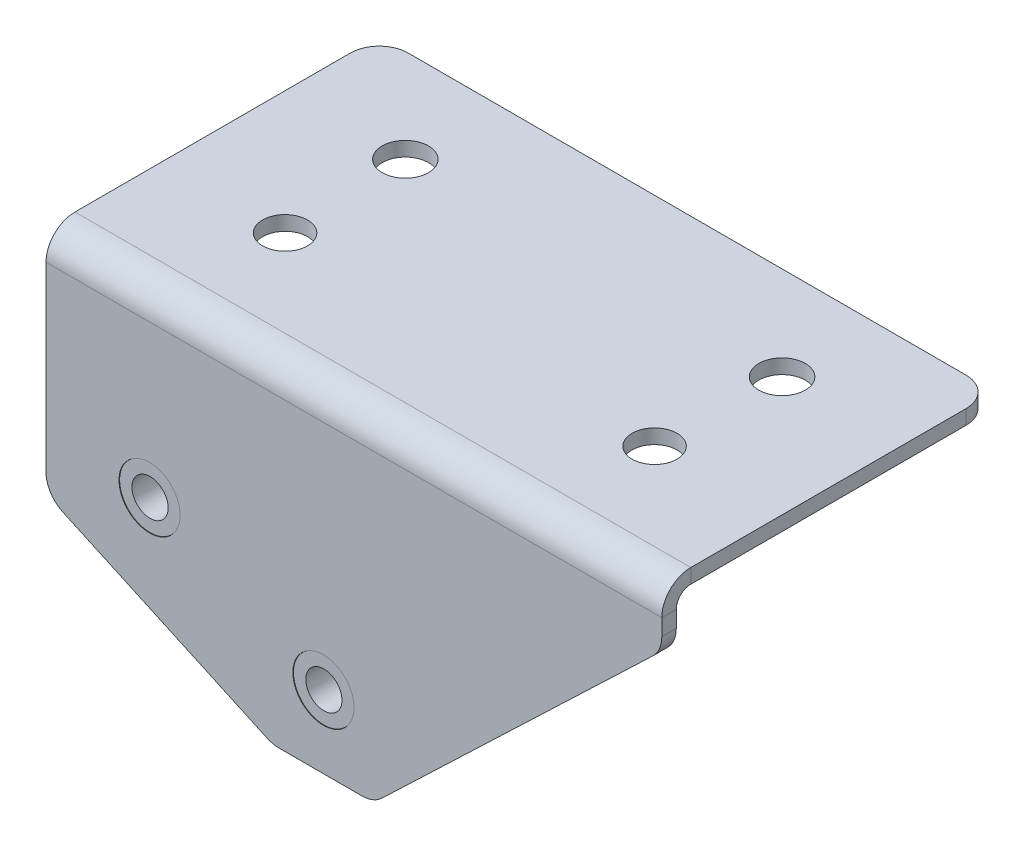
ISO-10303-21;
HEADER;
FILE_DESCRIPTION(('STEP AP214'),'2;1');
FILE_NAME('part.step','',(''),(''),'','','');
FILE_SCHEMA(('AUTOMOTIVE_DESIGN { 1 0 10303 214 1 1 1 1 }'));
ENDSEC;
DATA;
#1=APPLICATION_CONTEXT('core data for automotive mechanical design processes');
#2=APPLICATION_PROTOCOL_DEFINITION('international standard','automotive_design',2000,#1);
#3=PRODUCT_CONTEXT('',#1,'mechanical');
#4=PRODUCT('Part','Part','',(#3));
#5=PRODUCT_RELATED_PRODUCT_CATEGORY('part','',(#4));
#6=PRODUCT_DEFINITION_FORMATION('','',#4);
#7=PRODUCT_DEFINITION_CONTEXT('part definition',#1,'design');
#8=PRODUCT_DEFINITION('design','',#6,#7);
#9=PRODUCT_DEFINITION_SHAPE('','',#8);
#10=(LENGTH_UNIT() NAMED_UNIT(*) SI_UNIT(.MILLI.,.METRE.));
#11=(NAMED_UNIT(*) PLANE_ANGLE_UNIT() SI_UNIT($,.RADIAN.));
#12=(NAMED_UNIT(*) SI_UNIT($,.STERADIAN.) SOLID_ANGLE_UNIT());
#13=UNCERTAINTY_MEASURE_WITH_UNIT(LENGTH_MEASURE(1.E-05),#10,'distance_accuracy_value','');
#14=(GEOMETRIC_REPRESENTATION_CONTEXT(3) GLOBAL_UNCERTAINTY_ASSIGNED_CONTEXT((#13)) GLOBAL_UNIT_ASSIGNED_CONTEXT((#10,
#11,#12)) REPRESENTATION_CONTEXT('',''));
#15=CARTESIAN_POINT('',(0.,0.,0.));
#16=DIRECTION('',(0.,0.,1.));
#17=DIRECTION('',(1.,0.,0.));
#18=AXIS2_PLACEMENT_3D('',#15,#16,#17);
#19=CARTESIAN_POINT('',(7.14999999999999,10.5,-2.5));
#20=DIRECTION('',(0.,0.,1.));
#21=DIRECTION('',(1.,0.,0.));
#22=AXIS2_PLACEMENT_3D('',#19,#20,#21);
#23=PLANE('',#22);
#24=CARTESIAN_POINT('',(7.14999999999999,10.5,-2.5));
#25=DIRECTION('',(0.,0.,-1.));
#26=DIRECTION('',(0.,1.,0.));
#27=AXIS2_PLACEMENT_3D('',#24,#25,#26);
#28=CIRCLE('',#27,1.24999999999999);
#29=CARTESIAN_POINT('',(7.14999999999999,11.75,-2.5));
#30=VERTEX_POINT('',#29);
#31=EDGE_CURVE('E69',#30,#30,#28,.T.);
#32=ORIENTED_EDGE('',*,*,#31,.F.);
#33=EDGE_LOOP('',(#32));
#34=FACE_BOUND('',#33,.T.);
#35=CARTESIAN_POINT('',(7.14999999999999,10.5,-2.5));
#36=DIRECTION('',(0.,0.,-1.));
#37=DIRECTION('',(-1.,0.,0.));
#38=AXIS2_PLACEMENT_3D('',#35,#36,#37);
#39=CIRCLE('',#38,3.15);
#40=CARTESIAN_POINT('',(3.99999999999999,10.5,-2.5));
#41=VERTEX_POINT('',#40);
#42=EDGE_CURVE('E11',#41,#41,#39,.T.);
#43=ORIENTED_EDGE('',*,*,#42,.T.);
#44=EDGE_LOOP('',(#43));
#45=FACE_BOUND('',#44,.T.);
#46=ADVANCED_FACE('F47',(#34,#45),#23,.F.);
#47=CARTESIAN_POINT('',(7.14999999999999,10.5,-2.5));
#48=DIRECTION('',(0.,0.,-1.));
#49=DIRECTION('',(-1.,0.,0.));
#50=AXIS2_PLACEMENT_3D('',#47,#48,#49);
#51=CYLINDRICAL_SURFACE('',#50,3.15);
#52=ORIENTED_EDGE('',*,*,#42,.F.);
#53=EDGE_LOOP('',(#52));
#54=FACE_BOUND('',#53,.T.);
#55=CARTESIAN_POINT('',(7.14999999999999,10.5,-1.));
#56=DIRECTION('',(0.,0.,-1.));
#57=DIRECTION('',(-1.,0.,0.));
#58=AXIS2_PLACEMENT_3D('',#55,#56,#57);
#59=CIRCLE('',#58,3.15);
#60=CARTESIAN_POINT('',(3.99999999999999,10.5,-1.));
#61=VERTEX_POINT('',#60);
#62=EDGE_CURVE('E53',#61,#61,#59,.T.);
#63=ORIENTED_EDGE('',*,*,#62,.T.);
#64=EDGE_LOOP('',(#63));
#65=FACE_BOUND('',#64,.T.);
#66=ADVANCED_FACE('F77',(#54,#65),#51,.T.);
#67=CARTESIAN_POINT('',(10.3,10.5,-1.));
#68=DIRECTION('',(0.,0.,-1.));
#69=DIRECTION('',(-1.,0.,0.));
#70=AXIS2_PLACEMENT_3D('',#67,#68,#69);
#71=PLANE('',#70);
#72=ORIENTED_EDGE('',*,*,#62,.F.);
#73=EDGE_LOOP('',(#72));
#74=FACE_BOUND('',#73,.T.);
#75=CARTESIAN_POINT('',(7.14999999999999,10.5,-1.));
#76=DIRECTION('',(0.,0.,-1.));
#77=DIRECTION('',(-1.,0.,0.));
#78=AXIS2_PLACEMENT_3D('',#75,#76,#77);
#79=CIRCLE('',#78,2.1);
#80=CARTESIAN_POINT('',(5.04999999999998,10.5,-1.));
#81=VERTEX_POINT('',#80);
#82=EDGE_CURVE('E57',#81,#81,#79,.T.);
#83=ORIENTED_EDGE('',*,*,#82,.T.);
#84=EDGE_LOOP('',(#83));
#85=FACE_BOUND('',#84,.T.);
#86=ADVANCED_FACE('F81',(#74,#85),#71,.F.);
#87=CARTESIAN_POINT('',(7.14999999999999,10.5,-2.5));
#88=DIRECTION('',(0.,0.,-1.));
#89=DIRECTION('',(-1.,0.,0.));
#90=AXIS2_PLACEMENT_3D('',#87,#88,#89);
#91=CYLINDRICAL_SURFACE('',#90,2.1);
#92=ORIENTED_EDGE('',*,*,#82,.F.);
#93=EDGE_LOOP('',(#92));
#94=FACE_BOUND('',#93,.T.);
#95=CARTESIAN_POINT('',(7.14999999999999,10.5,-0.0300000000000014));
#96=DIRECTION('',(0.,0.,-1.));
#97=DIRECTION('',(-1.,0.,0.));
#98=AXIS2_PLACEMENT_3D('',#95,#96,#97);
#99=CIRCLE('',#98,2.1);
#100=CARTESIAN_POINT('',(5.04999999999998,10.5,-0.0300000000000014));
#101=VERTEX_POINT('',#100);
#102=EDGE_CURVE('E61',#101,#101,#99,.T.);
#103=ORIENTED_EDGE('',*,*,#102,.T.);
#104=EDGE_LOOP('',(#103));
#105=FACE_BOUND('',#104,.T.);
#106=ADVANCED_FACE('F86',(#94,#105),#91,.T.);
#107=CARTESIAN_POINT('',(9.24999999999999,10.5,-0.0300000000000014));
#108=DIRECTION('',(0.,0.,-1.));
#109=DIRECTION('',(-1.,0.,0.));
#110=AXIS2_PLACEMENT_3D('',#107,#108,#109);
#111=PLANE('',#110);
#112=CARTESIAN_POINT('',(7.14999999999999,10.5,-0.0300000000000014));
#113=DIRECTION('',(0.,0.,-1.));
#114=DIRECTION('',(-1.,0.,0.));
#115=AXIS2_PLACEMENT_3D('',#112,#113,#114);
#116=CIRCLE('',#115,1.24999999999999);
#117=CARTESIAN_POINT('',(5.9,10.5,-0.0300000000000014));
#118=VERTEX_POINT('',#117);
#119=EDGE_CURVE('E66',#118,#118,#116,.T.);
#120=ORIENTED_EDGE('',*,*,#119,.T.);
#121=EDGE_LOOP('',(#120));
#122=FACE_BOUND('',#121,.T.);
#123=ORIENTED_EDGE('',*,*,#102,.F.);
#124=EDGE_LOOP('',(#123));
#125=FACE_BOUND('',#124,.T.);
#126=ADVANCED_FACE('F92',(#122,#125),#111,.F.);
#127=CARTESIAN_POINT('',(7.14999999999999,10.5,-2.5));
#128=DIRECTION('',(0.,0.,-1.));
#129=DIRECTION('',(0.,1.,0.));
#130=AXIS2_PLACEMENT_3D('',#127,#128,#129);
#131=CYLINDRICAL_SURFACE('',#130,1.24999999999999);
#132=ORIENTED_EDGE('',*,*,#31,.T.);
#133=EDGE_LOOP('',(#132));
#134=FACE_BOUND('',#133,.T.);
#135=ORIENTED_EDGE('',*,*,#119,.F.);
#136=EDGE_LOOP('',(#135));
#137=FACE_BOUND('',#136,.T.);
#138=ADVANCED_FACE('F73',(#134,#137),#131,.F.);
#139=CLOSED_SHELL('',(#46,#66,#86,#106,#126,#138));
#140=MANIFOLD_SOLID_BREP('B2',#139);
#141=CARTESIAN_POINT('',(19.15,5.,-2.5));
#142=DIRECTION('',(0.,0.,1.));
#143=DIRECTION('',(1.,0.,0.));
#144=AXIS2_PLACEMENT_3D('',#141,#142,#143);
#145=PLANE('',#144);
#146=CARTESIAN_POINT('',(19.15,5.,-2.5));
#147=DIRECTION('',(0.,0.,-1.));
#148=DIRECTION('',(0.,1.,0.));
#149=AXIS2_PLACEMENT_3D('',#146,#147,#148);
#150=CIRCLE('',#149,1.24999999999999);
#151=CARTESIAN_POINT('',(19.15,6.24999999999999,-2.5));
#152=VERTEX_POINT('',#151);
#153=EDGE_CURVE('E184',#152,#152,#150,.T.);
#154=ORIENTED_EDGE('',*,*,#153,.F.);
#155=EDGE_LOOP('',(#154));
#156=FACE_BOUND('',#155,.T.);
#157=CARTESIAN_POINT('',(19.15,5.,-2.5));
#158=DIRECTION('',(0.,0.,-1.));
#159=DIRECTION('',(-1.,0.,0.));
#160=AXIS2_PLACEMENT_3D('',#157,#158,#159);
#161=CIRCLE('',#160,3.15);
#162=CARTESIAN_POINT('',(16.,5.,-2.5));
#163=VERTEX_POINT('',#162);
#164=EDGE_CURVE('E46',#163,#163,#161,.T.);
#165=ORIENTED_EDGE('',*,*,#164,.T.);
#166=EDGE_LOOP('',(#165));
#167=FACE_BOUND('',#166,.T.);
#168=ADVANCED_FACE('F162',(#156,#167),#145,.F.);
#169=CARTESIAN_POINT('',(19.15,5.,-2.5));
#170=DIRECTION('',(0.,0.,-1.));
#171=DIRECTION('',(-1.,0.,0.));
#172=AXIS2_PLACEMENT_3D('',#169,#170,#171);
#173=CYLINDRICAL_SURFACE('',#172,3.15);
#174=ORIENTED_EDGE('',*,*,#164,.F.);
#175=EDGE_LOOP('',(#174));
#176=FACE_BOUND('',#175,.T.);
#177=CARTESIAN_POINT('',(19.15,5.,-1.));
#178=DIRECTION('',(0.,0.,-1.));
#179=DIRECTION('',(-1.,0.,0.));
#180=AXIS2_PLACEMENT_3D('',#177,#178,#179);
#181=CIRCLE('',#180,3.15);
#182=CARTESIAN_POINT('',(16.,5.,-1.));
#183=VERTEX_POINT('',#182);
#184=EDGE_CURVE('E168',#183,#183,#181,.T.);
#185=ORIENTED_EDGE('',*,*,#184,.T.);
#186=EDGE_LOOP('',(#185));
#187=FACE_BOUND('',#186,.T.);
#188=ADVANCED_FACE('F192',(#176,#187),#173,.T.);
#189=CARTESIAN_POINT('',(22.3,5.,-1.));
#190=DIRECTION('',(0.,0.,-1.));
#191=DIRECTION('',(-1.,0.,0.));
#192=AXIS2_PLACEMENT_3D('',#189,#190,#191);
#193=PLANE('',#192);
#194=ORIENTED_EDGE('',*,*,#184,.F.);
#195=EDGE_LOOP('',(#194));
#196=FACE_BOUND('',#195,.T.);
#197=CARTESIAN_POINT('',(19.15,5.,-1.));
#198=DIRECTION('',(0.,0.,-1.));
#199=DIRECTION('',(-1.,0.,0.));
#200=AXIS2_PLACEMENT_3D('',#197,#198,#199);
#201=CIRCLE('',#200,2.1);
#202=CARTESIAN_POINT('',(17.05,5.,-1.));
#203=VERTEX_POINT('',#202);
#204=EDGE_CURVE('E172',#203,#203,#201,.T.);
#205=ORIENTED_EDGE('',*,*,#204,.T.);
#206=EDGE_LOOP('',(#205));
#207=FACE_BOUND('',#206,.T.);
#208=ADVANCED_FACE('F196',(#196,#207),#193,.F.);
#209=CARTESIAN_POINT('',(19.15,5.,-2.5));
#210=DIRECTION('',(0.,0.,-1.));
#211=DIRECTION('',(-1.,0.,0.));
#212=AXIS2_PLACEMENT_3D('',#209,#210,#211);
#213=CYLINDRICAL_SURFACE('',#212,2.1);
#214=ORIENTED_EDGE('',*,*,#204,.F.);
#215=EDGE_LOOP('',(#214));
#216=FACE_BOUND('',#215,.T.);
#217=CARTESIAN_POINT('',(19.15,5.,-0.0300000000000018));
#218=DIRECTION('',(0.,0.,-1.));
#219=DIRECTION('',(-1.,0.,0.));
#220=AXIS2_PLACEMENT_3D('',#217,#218,#219);
#221=CIRCLE('',#220,2.1);
#222=CARTESIAN_POINT('',(17.05,5.,-0.0300000000000018));
#223=VERTEX_POINT('',#222);
#224=EDGE_CURVE('E176',#223,#223,#221,.T.);
#225=ORIENTED_EDGE('',*,*,#224,.T.);
#226=EDGE_LOOP('',(#225));
#227=FACE_BOUND('',#226,.T.);
#228=ADVANCED_FACE('F201',(#216,#227),#213,.T.);
#229=CARTESIAN_POINT('',(21.25,5.,-0.0300000000000016));
#230=DIRECTION('',(0.,0.,-1.));
#231=DIRECTION('',(-1.,0.,0.));
#232=AXIS2_PLACEMENT_3D('',#229,#230,#231);
#233=PLANE('',#232);
#234=CARTESIAN_POINT('',(19.15,5.,-0.0300000000000018));
#235=DIRECTION('',(0.,0.,-1.));
#236=DIRECTION('',(-1.,0.,0.));
#237=AXIS2_PLACEMENT_3D('',#234,#235,#236);
#238=CIRCLE('',#237,1.24999999999999);
#239=CARTESIAN_POINT('',(17.9,5.,-0.0300000000000018));
#240=VERTEX_POINT('',#239);
#241=EDGE_CURVE('E181',#240,#240,#238,.T.);
#242=ORIENTED_EDGE('',*,*,#241,.T.);
#243=EDGE_LOOP('',(#242));
#244=FACE_BOUND('',#243,.T.);
#245=ORIENTED_EDGE('',*,*,#224,.F.);
#246=EDGE_LOOP('',(#245));
#247=FACE_BOUND('',#246,.T.);
#248=ADVANCED_FACE('F207',(#244,#247),#233,.F.);
#249=CARTESIAN_POINT('',(19.15,5.,-2.5));
#250=DIRECTION('',(0.,0.,-1.));
#251=DIRECTION('',(0.,1.,0.));
#252=AXIS2_PLACEMENT_3D('',#249,#250,#251);
#253=CYLINDRICAL_SURFACE('',#252,1.24999999999999);
#254=ORIENTED_EDGE('',*,*,#153,.T.);
#255=EDGE_LOOP('',(#254));
#256=FACE_BOUND('',#255,.T.);
#257=ORIENTED_EDGE('',*,*,#241,.F.);
#258=EDGE_LOOP('',(#257));
#259=FACE_BOUND('',#258,.T.);
#260=ADVANCED_FACE('F188',(#256,#259),#253,.F.);
#261=CLOSED_SHELL('',(#168,#188,#208,#228,#248,#260));
#262=MANIFOLD_SOLID_BREP('B6',#261);
#263=CARTESIAN_POINT('',(0.,0.,-1.));
#264=DIRECTION('',(0.,0.,-1.));
#265=DIRECTION('',(-1.,0.,0.));
#266=AXIS2_PLACEMENT_3D('',#263,#264,#265);
#267=PLANE('',#266);
#268=CARTESIAN_POINT('',(19.15,5.,-1.));
#269=DIRECTION('',(0.,0.,1.));
#270=DIRECTION('',(1.,0.,0.));
#271=AXIS2_PLACEMENT_3D('',#268,#269,#270);
#272=CIRCLE('',#271,2.11);
#273=CARTESIAN_POINT('',(21.26,5.,-1.));
#274=VERTEX_POINT('',#273);
#275=EDGE_CURVE('E528',#274,#274,#272,.T.);
#276=ORIENTED_EDGE('',*,*,#275,.T.);
#277=EDGE_LOOP('',(#276));
#278=FACE_BOUND('',#277,.T.);
#279=CARTESIAN_POINT('',(7.14999999999999,10.5,-1.));
#280=DIRECTION('',(0.,0.,1.));
#281=DIRECTION('',(1.,0.,0.));
#282=AXIS2_PLACEMENT_3D('',#279,#280,#281);
#283=CIRCLE('',#282,2.11);
#284=CARTESIAN_POINT('',(9.25999999999999,10.5,-1.));
#285=VERTEX_POINT('',#284);
#286=EDGE_CURVE('E523',#285,#285,#283,.T.);
#287=ORIENTED_EDGE('',*,*,#286,.T.);
#288=EDGE_LOOP('',(#287));
#289=FACE_BOUND('',#288,.T.);
#290=DIRECTION('',(0.,1.,0.));
#291=VECTOR('',#290,1.);
#292=CARTESIAN_POINT('',(42.5,0.,-1.));
#293=LINE('',#292,#291);
#294=CARTESIAN_POINT('',(42.5,19.8556065200386,-1.));
#295=VERTEX_POINT('',#294);
#296=CARTESIAN_POINT('',(42.5,21.,-1.));
#297=VERTEX_POINT('',#296);
#298=EDGE_CURVE('E448',#295,#297,#293,.T.);
#299=ORIENTED_EDGE('',*,*,#298,.F.);
#300=CARTESIAN_POINT('',(40.5,19.8556065200386,-1.));
#301=DIRECTION('',(0.,0.,-1.));
#302=DIRECTION('',(-1.,0.,0.));
#303=AXIS2_PLACEMENT_3D('',#300,#301,#302);
#304=CIRCLE('',#303,2.);
#305=CARTESIAN_POINT('',(41.8811894796554,18.4091226378991,-1.));
#306=VERTEX_POINT('',#305);
#307=EDGE_CURVE('E477',#295,#306,#304,.T.);
#308=ORIENTED_EDGE('',*,*,#307,.T.);
#309=DIRECTION('',(0.723241941069744,0.690594739827686,0.));
#310=VECTOR('',#309,1.);
#311=CARTESIAN_POINT('',(10.7792720014158,-11.2888517042107,-1.));
#312=LINE('',#311,#310);
#313=CARTESIAN_POINT('',(23.1814763573797,0.553516117860515,-1.));
#314=VERTEX_POINT('',#313);
#315=EDGE_CURVE('E537',#314,#306,#312,.T.);
#316=ORIENTED_EDGE('',*,*,#315,.F.);
#317=CARTESIAN_POINT('',(21.8002868777243,2.,-1.));
#318=DIRECTION('',(0.,0.,-1.));
#319=DIRECTION('',(-1.,0.,0.));
#320=AXIS2_PLACEMENT_3D('',#317,#318,#319);
#321=CIRCLE('',#320,2.);
#322=CARTESIAN_POINT('',(21.8002868777243,0.,-1.));
#323=VERTEX_POINT('',#322);
#324=EDGE_CURVE('E475',#314,#323,#321,.T.);
#325=ORIENTED_EDGE('',*,*,#324,.T.);
#326=DIRECTION('',(1.,0.,0.));
#327=VECTOR('',#326,1.);
#328=CARTESIAN_POINT('',(0.,0.,-1.));
#329=LINE('',#328,#327);
#330=CARTESIAN_POINT('',(16.0951790673134,0.,-1.));
#331=VERTEX_POINT('',#330);
#332=EDGE_CURVE('E444',#331,#323,#329,.T.);
#333=ORIENTED_EDGE('',*,*,#332,.F.);
#334=CARTESIAN_POINT('',(16.0951790673134,2.,-1.));
#335=DIRECTION('',(0.,0.,-1.));
#336=DIRECTION('',(-1.,0.,0.));
#337=AXIS2_PLACEMENT_3D('',#334,#335,#336);
#338=CIRCLE('',#337,2.);
#339=CARTESIAN_POINT('',(15.261869646327,0.18187035421143,-1.));
#340=VERTEX_POINT('',#339);
#341=EDGE_CURVE('E473',#331,#340,#338,.T.);
#342=ORIENTED_EDGE('',*,*,#341,.T.);
#343=DIRECTION('',(0.909064822894284,-0.416654710493214,0.));
#344=VECTOR('',#343,1.);
#345=CARTESIAN_POINT('',(2.71836441996754,5.93097691629283,-1.));
#346=LINE('',#345,#344);
#347=CARTESIAN_POINT('',(1.16669057901357,6.6421607600634,-1.));
#348=VERTEX_POINT('',#347);
#349=EDGE_CURVE('E543',#348,#340,#346,.T.);
#350=ORIENTED_EDGE('',*,*,#349,.F.);
#351=CARTESIAN_POINT('',(1.99999999999999,8.46029040585197,-1.));
#352=DIRECTION('',(0.,0.,-1.));
#353=DIRECTION('',(-1.,0.,0.));
#354=AXIS2_PLACEMENT_3D('',#351,#352,#353);
#355=CIRCLE('',#354,2.);
#356=CARTESIAN_POINT('',(0.,8.46029040585197,-1.));
#357=VERTEX_POINT('',#356);
#358=EDGE_CURVE('E471',#348,#357,#355,.T.);
#359=ORIENTED_EDGE('',*,*,#358,.T.);
#360=DIRECTION('',(0.,-1.,0.));
#361=VECTOR('',#360,1.);
#362=CARTESIAN_POINT('',(0.,0.,-1.));
#363=LINE('',#362,#361);
#364=CARTESIAN_POINT('',(0.,21.,-1.));
#365=VERTEX_POINT('',#364);
#366=EDGE_CURVE('E441',#365,#357,#363,.T.);
#367=ORIENTED_EDGE('',*,*,#366,.F.);
#368=DIRECTION('',(1.,0.,0.));
#369=VECTOR('',#368,1.);
#370=CARTESIAN_POINT('',(42.5,21.,-1.));
#371=LINE('',#370,#369);
#372=EDGE_CURVE('E431',#297,#365,#371,.F.);
#373=ORIENTED_EDGE('',*,*,#372,.F.);
#374=EDGE_LOOP('',(#299,#308,#316,#325,#333,#342,#350,#359,#367,#373));
#375=FACE_BOUND('',#374,.T.);
#376=ADVANCED_FACE('F268',(#278,#289,#375),#267,.T.);
#377=CARTESIAN_POINT('',(0.,0.,0.));
#378=DIRECTION('',(0.,0.,-1.));
#379=DIRECTION('',(-1.,0.,0.));
#380=AXIS2_PLACEMENT_3D('',#377,#378,#379);
#381=PLANE('',#380);
#382=CARTESIAN_POINT('',(19.15,5.,0.));
#383=DIRECTION('',(0.,0.,1.));
#384=DIRECTION('',(1.,0.,0.));
#385=AXIS2_PLACEMENT_3D('',#382,#383,#384);
#386=CIRCLE('',#385,2.11);
#387=CARTESIAN_POINT('',(21.26,5.,0.));
#388=VERTEX_POINT('',#387);
#389=EDGE_CURVE('E531',#388,#388,#386,.T.);
#390=ORIENTED_EDGE('',*,*,#389,.F.);
#391=EDGE_LOOP('',(#390));
#392=FACE_BOUND('',#391,.T.);
#393=CARTESIAN_POINT('',(7.14999999999999,10.5,0.));
#394=DIRECTION('',(0.,0.,1.));
#395=DIRECTION('',(1.,0.,0.));
#396=AXIS2_PLACEMENT_3D('',#393,#394,#395);
#397=CIRCLE('',#396,2.11);
#398=CARTESIAN_POINT('',(9.25999999999999,10.5,0.));
#399=VERTEX_POINT('',#398);
#400=EDGE_CURVE('E525',#399,#399,#397,.T.);
#401=ORIENTED_EDGE('',*,*,#400,.F.);
#402=EDGE_LOOP('',(#401));
#403=FACE_BOUND('',#402,.T.);
#404=DIRECTION('',(0.723241941069744,0.690594739827686,0.));
#405=VECTOR('',#404,1.);
#406=CARTESIAN_POINT('',(10.7792720014158,-11.2888517042107,0.));
#407=LINE('',#406,#405);
#408=CARTESIAN_POINT('',(23.1814763573797,0.553516117860515,0.));
#409=VERTEX_POINT('',#408);
#410=CARTESIAN_POINT('',(41.8811894796554,18.4091226378991,0.));
#411=VERTEX_POINT('',#410);
#412=EDGE_CURVE('E534',#409,#411,#407,.T.);
#413=ORIENTED_EDGE('',*,*,#412,.T.);
#414=CARTESIAN_POINT('',(40.5,19.8556065200386,0.));
#415=DIRECTION('',(0.,0.,-1.));
#416=DIRECTION('',(-1.,0.,0.));
#417=AXIS2_PLACEMENT_3D('',#414,#415,#416);
#418=CIRCLE('',#417,2.);
#419=CARTESIAN_POINT('',(42.5,19.8556065200386,0.));
#420=VERTEX_POINT('',#419);
#421=EDGE_CURVE('E467',#411,#420,#418,.F.);
#422=ORIENTED_EDGE('',*,*,#421,.T.);
#423=DIRECTION('',(0.,1.,0.));
#424=VECTOR('',#423,1.);
#425=CARTESIAN_POINT('',(42.5,0.,0.));
#426=LINE('',#425,#424);
#427=CARTESIAN_POINT('',(42.5,21.,0.));
#428=VERTEX_POINT('',#427);
#429=EDGE_CURVE('E445',#420,#428,#426,.T.);
#430=ORIENTED_EDGE('',*,*,#429,.T.);
#431=DIRECTION('',(1.,0.,0.));
#432=VECTOR('',#431,1.);
#433=CARTESIAN_POINT('',(42.5,21.,0.));
#434=LINE('',#433,#432);
#435=CARTESIAN_POINT('',(0.,21.,0.));
#436=VERTEX_POINT('',#435);
#437=EDGE_CURVE('E391',#428,#436,#434,.F.);
#438=ORIENTED_EDGE('',*,*,#437,.T.);
#439=DIRECTION('',(0.,-1.,0.));
#440=VECTOR('',#439,1.);
#441=CARTESIAN_POINT('',(0.,0.,0.));
#442=LINE('',#441,#440);
#443=CARTESIAN_POINT('',(0.,8.46029040585197,0.));
#444=VERTEX_POINT('',#443);
#445=EDGE_CURVE('E438',#436,#444,#442,.T.);
#446=ORIENTED_EDGE('',*,*,#445,.T.);
#447=CARTESIAN_POINT('',(1.99999999999999,8.46029040585197,0.));
#448=DIRECTION('',(0.,0.,-1.));
#449=DIRECTION('',(-1.,0.,0.));
#450=AXIS2_PLACEMENT_3D('',#447,#448,#449);
#451=CIRCLE('',#450,2.);
#452=CARTESIAN_POINT('',(1.16669057901357,6.6421607600634,0.));
#453=VERTEX_POINT('',#452);
#454=EDGE_CURVE('E461',#444,#453,#451,.F.);
#455=ORIENTED_EDGE('',*,*,#454,.T.);
#456=DIRECTION('',(0.909064822894284,-0.416654710493214,0.));
#457=VECTOR('',#456,1.);
#458=CARTESIAN_POINT('',(2.71836441996754,5.93097691629283,0.));
#459=LINE('',#458,#457);
#460=CARTESIAN_POINT('',(15.261869646327,0.18187035421143,0.));
#461=VERTEX_POINT('',#460);
#462=EDGE_CURVE('E540',#453,#461,#459,.T.);
#463=ORIENTED_EDGE('',*,*,#462,.T.);
#464=CARTESIAN_POINT('',(16.0951790673134,2.,0.));
#465=DIRECTION('',(0.,0.,-1.));
#466=DIRECTION('',(-1.,0.,0.));
#467=AXIS2_PLACEMENT_3D('',#464,#465,#466);
#468=CIRCLE('',#467,2.);
#469=CARTESIAN_POINT('',(16.0951790673134,0.,0.));
#470=VERTEX_POINT('',#469);
#471=EDGE_CURVE('E463',#461,#470,#468,.F.);
#472=ORIENTED_EDGE('',*,*,#471,.T.);
#473=DIRECTION('',(1.,0.,0.));
#474=VECTOR('',#473,1.);
#475=CARTESIAN_POINT('',(0.,0.,0.));
#476=LINE('',#475,#474);
#477=CARTESIAN_POINT('',(21.8002868777243,0.,0.));
#478=VERTEX_POINT('',#477);
#479=EDGE_CURVE('E453',#470,#478,#476,.T.);
#480=ORIENTED_EDGE('',*,*,#479,.T.);
#481=CARTESIAN_POINT('',(21.8002868777243,2.,0.));
#482=DIRECTION('',(0.,0.,-1.));
#483=DIRECTION('',(-1.,0.,0.));
#484=AXIS2_PLACEMENT_3D('',#481,#482,#483);
#485=CIRCLE('',#484,2.);
#486=EDGE_CURVE('E465',#478,#409,#485,.F.);
#487=ORIENTED_EDGE('',*,*,#486,.T.);
#488=EDGE_LOOP('',(#413,#422,#430,#438,#446,#455,#463,#472,#480,#487));
#489=FACE_BOUND('',#488,.T.);
#490=ADVANCED_FACE('F605',(#392,#403,#489),#381,.F.);
#491=CARTESIAN_POINT('',(0.,0.,-1.));
#492=DIRECTION('',(0.,-1.,0.));
#493=DIRECTION('',(0.,0.,-1.));
#494=AXIS2_PLACEMENT_3D('',#491,#492,#493);
#495=PLANE('',#494);
#496=ORIENTED_EDGE('',*,*,#332,.T.);
#497=DIRECTION('',(0.,0.,-1.));
#498=VECTOR('',#497,1.);
#499=CARTESIAN_POINT('',(21.8002868777243,0.,-1.));
#500=LINE('',#499,#498);
#501=EDGE_CURVE('E481',#323,#478,#500,.F.);
#502=ORIENTED_EDGE('',*,*,#501,.T.);
#503=ORIENTED_EDGE('',*,*,#479,.F.);
#504=DIRECTION('',(0.,0.,-1.));
#505=VECTOR('',#504,1.);
#506=CARTESIAN_POINT('',(16.0951790673134,0.,-1.));
#507=LINE('',#506,#505);
#508=EDGE_CURVE('E479',#470,#331,#507,.T.);
#509=ORIENTED_EDGE('',*,*,#508,.T.);
#510=EDGE_LOOP('',(#496,#502,#503,#509));
#511=FACE_BOUND('',#510,.T.);
#512=ADVANCED_FACE('F611',(#511),#495,.T.);
#513=CARTESIAN_POINT('',(0.,0.,-1.));
#514=DIRECTION('',(-1.,0.,0.));
#515=DIRECTION('',(0.,-1.,0.));
#516=AXIS2_PLACEMENT_3D('',#513,#514,#515);
#517=PLANE('',#516);
#518=ORIENTED_EDGE('',*,*,#366,.T.);
#519=DIRECTION('',(0.,0.,-1.));
#520=VECTOR('',#519,1.);
#521=CARTESIAN_POINT('',(0.,8.46029040585197,-1.));
#522=LINE('',#521,#520);
#523=EDGE_CURVE('E489',#357,#444,#522,.F.);
#524=ORIENTED_EDGE('',*,*,#523,.T.);
#525=ORIENTED_EDGE('',*,*,#445,.F.);
#526=DIRECTION('',(0.,0.,1.));
#527=VECTOR('',#526,1.);
#528=CARTESIAN_POINT('',(0.,21.,-1.));
#529=LINE('',#528,#527);
#530=EDGE_CURVE('E435',#365,#436,#529,.T.);
#531=ORIENTED_EDGE('',*,*,#530,.F.);
#532=EDGE_LOOP('',(#518,#524,#525,#531));
#533=FACE_BOUND('',#532,.T.);
#534=ADVANCED_FACE('F622',(#533),#517,.T.);
#535=CARTESIAN_POINT('',(42.5,0.,-1.));
#536=DIRECTION('',(1.,0.,0.));
#537=DIRECTION('',(0.,0.,-1.));
#538=AXIS2_PLACEMENT_3D('',#535,#536,#537);
#539=PLANE('',#538);
#540=ORIENTED_EDGE('',*,*,#429,.F.);
#541=DIRECTION('',(0.,0.,-1.));
#542=VECTOR('',#541,1.);
#543=CARTESIAN_POINT('',(42.5,19.8556065200386,-1.));
#544=LINE('',#543,#542);
#545=EDGE_CURVE('E469',#420,#295,#544,.T.);
#546=ORIENTED_EDGE('',*,*,#545,.T.);
#547=ORIENTED_EDGE('',*,*,#298,.T.);
#548=DIRECTION('',(0.,0.,1.));
#549=VECTOR('',#548,1.);
#550=CARTESIAN_POINT('',(42.5,21.,-1.));
#551=LINE('',#550,#549);
#552=EDGE_CURVE('E427',#297,#428,#551,.T.);
#553=ORIENTED_EDGE('',*,*,#552,.T.);
#554=EDGE_LOOP('',(#540,#546,#547,#553));
#555=FACE_BOUND('',#554,.T.);
#556=ADVANCED_FACE('F618',(#555),#539,.T.);
#557=CARTESIAN_POINT('',(0.,21.,-2.));
#558=DIRECTION('',(-1.,0.,0.));
#559=DIRECTION('',(0.,0.,1.));
#560=AXIS2_PLACEMENT_3D('',#557,#558,#559);
#561=PLANE('',#560);
#562=DIRECTION('',(0.,1.,0.));
#563=VECTOR('',#562,1.);
#564=CARTESIAN_POINT('',(0.,22.,-2.));
#565=LINE('',#564,#563);
#566=CARTESIAN_POINT('',(0.,22.,-2.));
#567=VERTEX_POINT('',#566);
#568=CARTESIAN_POINT('',(0.,23.,-1.99999999999999));
#569=VERTEX_POINT('',#568);
#570=EDGE_CURVE('E512',#567,#569,#565,.T.);
#571=ORIENTED_EDGE('',*,*,#570,.F.);
#572=CARTESIAN_POINT('',(0.,21.,-2.));
#573=DIRECTION('',(1.,0.,0.));
#574=DIRECTION('',(0.,0.,-1.));
#575=AXIS2_PLACEMENT_3D('',#572,#573,#574);
#576=CIRCLE('',#575,1.);
#577=EDGE_CURVE('E394',#365,#567,#576,.F.);
#578=ORIENTED_EDGE('',*,*,#577,.F.);
#579=ORIENTED_EDGE('',*,*,#530,.T.);
#580=CARTESIAN_POINT('',(0.,21.,-2.));
#581=DIRECTION('',(1.,0.,0.));
#582=DIRECTION('',(0.,0.,-1.));
#583=AXIS2_PLACEMENT_3D('',#580,#581,#582);
#584=CIRCLE('',#583,2.);
#585=EDGE_CURVE('E426',#436,#569,#584,.F.);
#586=ORIENTED_EDGE('',*,*,#585,.T.);
#587=EDGE_LOOP('',(#571,#578,#579,#586));
#588=FACE_BOUND('',#587,.T.);
#589=ADVANCED_FACE('F621',(#588),#561,.T.);
#590=CARTESIAN_POINT('',(42.5,21.,-2.));
#591=DIRECTION('',(-1.,0.,0.));
#592=DIRECTION('',(0.,0.,1.));
#593=AXIS2_PLACEMENT_3D('',#590,#591,#592);
#594=PLANE('',#593);
#595=CARTESIAN_POINT('',(42.5,21.,-2.));
#596=DIRECTION('',(1.,0.,0.));
#597=DIRECTION('',(0.,0.,-1.));
#598=AXIS2_PLACEMENT_3D('',#595,#596,#597);
#599=CIRCLE('',#598,1.);
#600=CARTESIAN_POINT('',(42.5,22.,-2.));
#601=VERTEX_POINT('',#600);
#602=EDGE_CURVE('E401',#601,#297,#599,.T.);
#603=ORIENTED_EDGE('',*,*,#602,.F.);
#604=DIRECTION('',(0.,1.,0.));
#605=VECTOR('',#604,1.);
#606=CARTESIAN_POINT('',(42.5,22.,-2.));
#607=LINE('',#606,#605);
#608=CARTESIAN_POINT('',(42.5,23.,-1.99999999999999));
#609=VERTEX_POINT('',#608);
#610=EDGE_CURVE('E398',#601,#609,#607,.T.);
#611=ORIENTED_EDGE('',*,*,#610,.T.);
#612=CARTESIAN_POINT('',(42.5,21.,-2.));
#613=DIRECTION('',(1.,0.,0.));
#614=DIRECTION('',(0.,0.,-1.));
#615=AXIS2_PLACEMENT_3D('',#612,#613,#614);
#616=CIRCLE('',#615,2.);
#617=EDGE_CURVE('E384',#609,#428,#616,.T.);
#618=ORIENTED_EDGE('',*,*,#617,.T.);
#619=ORIENTED_EDGE('',*,*,#552,.F.);
#620=EDGE_LOOP('',(#603,#611,#618,#619));
#621=FACE_BOUND('',#620,.T.);
#622=ADVANCED_FACE('F399',(#621),#594,.F.);
#623=CARTESIAN_POINT('',(42.5,21.,-2.));
#624=DIRECTION('',(1.,0.,0.));
#625=DIRECTION('',(0.,1.,0.));
#626=AXIS2_PLACEMENT_3D('',#623,#624,#625);
#627=CYLINDRICAL_SURFACE('',#626,2.);
#628=ORIENTED_EDGE('',*,*,#437,.F.);
#629=ORIENTED_EDGE('',*,*,#617,.F.);
#630=DIRECTION('',(-1.,0.,0.));
#631=VECTOR('',#630,1.);
#632=CARTESIAN_POINT('',(0.,23.,-1.99999999999999));
#633=LINE('',#632,#631);
#634=EDGE_CURVE('E389',#609,#569,#633,.T.);
#635=ORIENTED_EDGE('',*,*,#634,.T.);
#636=ORIENTED_EDGE('',*,*,#585,.F.);
#637=EDGE_LOOP('',(#628,#629,#635,#636));
#638=FACE_BOUND('',#637,.T.);
#639=ADVANCED_FACE('F386',(#638),#627,.T.);
#640=CARTESIAN_POINT('',(42.5,21.,-2.));
#641=DIRECTION('',(1.,0.,0.));
#642=DIRECTION('',(0.,1.,0.));
#643=AXIS2_PLACEMENT_3D('',#640,#641,#642);
#644=CYLINDRICAL_SURFACE('',#643,1.);
#645=ORIENTED_EDGE('',*,*,#372,.T.);
#646=ORIENTED_EDGE('',*,*,#577,.T.);
#647=DIRECTION('',(1.,0.,0.));
#648=VECTOR('',#647,1.);
#649=CARTESIAN_POINT('',(0.,22.,-2.));
#650=LINE('',#649,#648);
#651=EDGE_CURVE('E403',#567,#601,#650,.T.);
#652=ORIENTED_EDGE('',*,*,#651,.T.);
#653=ORIENTED_EDGE('',*,*,#602,.T.);
#654=EDGE_LOOP('',(#645,#646,#652,#653));
#655=FACE_BOUND('',#654,.T.);
#656=ADVANCED_FACE('F802',(#655),#644,.F.);
#657=CARTESIAN_POINT('',(42.5,23.0000000000001,-23.));
#658=DIRECTION('',(-1.,0.,0.));
#659=DIRECTION('',(0.,0.,1.));
#660=AXIS2_PLACEMENT_3D('',#657,#658,#659);
#661=PLANE('',#660);
#662=DIRECTION('',(0.,0.,-1.));
#663=VECTOR('',#662,1.);
#664=CARTESIAN_POINT('',(42.5,22.0000000000001,-23.));
#665=LINE('',#664,#663);
#666=CARTESIAN_POINT('',(42.5,22.0000000000001,-21.));
#667=VERTEX_POINT('',#666);
#668=EDGE_CURVE('E411',#601,#667,#665,.T.);
#669=ORIENTED_EDGE('',*,*,#668,.T.);
#670=DIRECTION('',(0.,-1.,0.));
#671=VECTOR('',#670,1.);
#672=CARTESIAN_POINT('',(42.5,23.0000000000001,-21.));
#673=LINE('',#672,#671);
#674=CARTESIAN_POINT('',(42.5,23.0000000000001,-21.));
#675=VERTEX_POINT('',#674);
#676=EDGE_CURVE('E160',#667,#675,#673,.F.);
#677=ORIENTED_EDGE('',*,*,#676,.T.);
#678=DIRECTION('',(0.,0.,-1.));
#679=VECTOR('',#678,1.);
#680=CARTESIAN_POINT('',(42.5,23.0000000000001,-23.));
#681=LINE('',#680,#679);
#682=EDGE_CURVE('E407',#609,#675,#681,.T.);
#683=ORIENTED_EDGE('',*,*,#682,.F.);
#684=ORIENTED_EDGE('',*,*,#610,.F.);
#685=EDGE_LOOP('',(#669,#677,#683,#684));
#686=FACE_BOUND('',#685,.T.);
#687=ADVANCED_FACE('F413',(#686),#661,.F.);
#688=CARTESIAN_POINT('',(0.,23.,-0.999999999999997));
#689=DIRECTION('',(1.,0.,0.));
#690=DIRECTION('',(0.,0.,-1.));
#691=AXIS2_PLACEMENT_3D('',#688,#689,#690);
#692=PLANE('',#691);
#693=DIRECTION('',(0.,0.,1.));
#694=VECTOR('',#693,1.);
#695=CARTESIAN_POINT('',(0.,23.,-0.999999999999997));
#696=LINE('',#695,#694);
#697=CARTESIAN_POINT('',(0.,23.0000000000001,-21.));
#698=VERTEX_POINT('',#697);
#699=EDGE_CURVE('E410',#698,#569,#696,.T.);
#700=ORIENTED_EDGE('',*,*,#699,.F.);
#701=DIRECTION('',(0.,-1.,0.));
#702=VECTOR('',#701,1.);
#703=CARTESIAN_POINT('',(0.,23.0000000000001,-21.));
#704=LINE('',#703,#702);
#705=CARTESIAN_POINT('',(0.,22.0000000000001,-21.));
#706=VERTEX_POINT('',#705);
#707=EDGE_CURVE('E492',#698,#706,#704,.T.);
#708=ORIENTED_EDGE('',*,*,#707,.T.);
#709=DIRECTION('',(0.,0.,1.));
#710=VECTOR('',#709,1.);
#711=CARTESIAN_POINT('',(0.,22.,-1.));
#712=LINE('',#711,#710);
#713=EDGE_CURVE('E415',#706,#567,#712,.T.);
#714=ORIENTED_EDGE('',*,*,#713,.T.);
#715=ORIENTED_EDGE('',*,*,#570,.T.);
#716=EDGE_LOOP('',(#700,#708,#714,#715));
#717=FACE_BOUND('',#716,.T.);
#718=ADVANCED_FACE('F509',(#717),#692,.F.);
#719=CARTESIAN_POINT('',(0.,23.,0.));
#720=DIRECTION('',(0.,-1.,0.));
#721=DIRECTION('',(0.,0.,-1.));
#722=AXIS2_PLACEMENT_3D('',#719,#720,#721);
#723=PLANE('',#722);
#724=CARTESIAN_POINT('',(34.25,23.0000000000001,-16.55));
#725=DIRECTION('',(0.,1.,0.));
#726=DIRECTION('',(0.,0.,-1.));
#727=AXIS2_PLACEMENT_3D('',#724,#725,#726);
#728=CIRCLE('',#727,1.6);
#729=CARTESIAN_POINT('',(34.25,23.0000000000001,-18.15));
#730=VERTEX_POINT('',#729);
#731=EDGE_CURVE('E567',#730,#730,#728,.T.);
#732=ORIENTED_EDGE('',*,*,#731,.F.);
#733=EDGE_LOOP('',(#732));
#734=FACE_BOUND('',#733,.T.);
#735=CARTESIAN_POINT('',(34.,23.,-8.));
#736=DIRECTION('',(0.,1.,0.));
#737=DIRECTION('',(0.,0.,-1.));
#738=AXIS2_PLACEMENT_3D('',#735,#736,#737);
#739=CIRCLE('',#738,1.55);
#740=CARTESIAN_POINT('',(34.,23.,-9.55));
#741=VERTEX_POINT('',#740);
#742=EDGE_CURVE('E561',#741,#741,#739,.T.);
#743=ORIENTED_EDGE('',*,*,#742,.F.);
#744=EDGE_LOOP('',(#743));
#745=FACE_BOUND('',#744,.T.);
#746=CARTESIAN_POINT('',(8.49999999999999,23.,-8.));
#747=DIRECTION('',(0.,1.,0.));
#748=DIRECTION('',(0.,0.,1.));
#749=AXIS2_PLACEMENT_3D('',#746,#747,#748);
#750=CIRCLE('',#749,1.55);
#751=CARTESIAN_POINT('',(8.49999999999999,23.,-6.45));
#752=VERTEX_POINT('',#751);
#753=EDGE_CURVE('E555',#752,#752,#750,.T.);
#754=ORIENTED_EDGE('',*,*,#753,.F.);
#755=EDGE_LOOP('',(#754));
#756=FACE_BOUND('',#755,.T.);
#757=CARTESIAN_POINT('',(8.24999999999999,23.0000000000001,-16.55));
#758=DIRECTION('',(0.,1.,0.));
#759=DIRECTION('',(0.,0.,1.));
#760=AXIS2_PLACEMENT_3D('',#757,#758,#759);
#761=CIRCLE('',#760,1.6);
#762=CARTESIAN_POINT('',(8.24999999999999,23.,-14.95));
#763=VERTEX_POINT('',#762);
#764=EDGE_CURVE('E549',#763,#763,#761,.T.);
#765=ORIENTED_EDGE('',*,*,#764,.F.);
#766=EDGE_LOOP('',(#765));
#767=FACE_BOUND('',#766,.T.);
#768=DIRECTION('',(-1.,0.,0.));
#769=VECTOR('',#768,1.);
#770=CARTESIAN_POINT('',(0.,23.0000000000001,-23.));
#771=LINE('',#770,#769);
#772=CARTESIAN_POINT('',(40.5,23.0000000000001,-23.));
#773=VERTEX_POINT('',#772);
#774=CARTESIAN_POINT('',(1.99999999999999,23.0000000000001,-23.));
#775=VERTEX_POINT('',#774);
#776=EDGE_CURVE('E414',#773,#775,#771,.T.);
#777=ORIENTED_EDGE('',*,*,#776,.T.);
#778=CARTESIAN_POINT('',(1.99999999999999,23.0000000000001,-21.));
#779=DIRECTION('',(0.,-1.,0.));
#780=DIRECTION('',(0.,0.,-1.));
#781=AXIS2_PLACEMENT_3D('',#778,#779,#780);
#782=CIRCLE('',#781,2.);
#783=EDGE_CURVE('E276',#775,#698,#782,.F.);
#784=ORIENTED_EDGE('',*,*,#783,.T.);
#785=ORIENTED_EDGE('',*,*,#699,.T.);
#786=ORIENTED_EDGE('',*,*,#634,.F.);
#787=ORIENTED_EDGE('',*,*,#682,.T.);
#788=CARTESIAN_POINT('',(40.5,23.0000000000001,-21.));
#789=DIRECTION('',(0.,-1.,0.));
#790=DIRECTION('',(0.,0.,-1.));
#791=AXIS2_PLACEMENT_3D('',#788,#789,#790);
#792=CIRCLE('',#791,2.);
#793=EDGE_CURVE('E503',#675,#773,#792,.F.);
#794=ORIENTED_EDGE('',*,*,#793,.T.);
#795=EDGE_LOOP('',(#777,#784,#785,#786,#787,#794));
#796=FACE_BOUND('',#795,.T.);
#797=ADVANCED_FACE('F406',(#734,#745,#756,#767,#796),#723,.F.);
#798=CARTESIAN_POINT('',(0.,22.,0.));
#799=DIRECTION('',(0.,-1.,0.));
#800=DIRECTION('',(0.,0.,-1.));
#801=AXIS2_PLACEMENT_3D('',#798,#799,#800);
#802=PLANE('',#801);
#803=CARTESIAN_POINT('',(34.25,22.0000000000001,-16.55));
#804=DIRECTION('',(0.,1.,0.));
#805=DIRECTION('',(0.,0.,-1.));
#806=AXIS2_PLACEMENT_3D('',#803,#804,#805);
#807=CIRCLE('',#806,1.6);
#808=CARTESIAN_POINT('',(34.25,22.0000000000001,-18.15));
#809=VERTEX_POINT('',#808);
#810=EDGE_CURVE('E564',#809,#809,#807,.T.);
#811=ORIENTED_EDGE('',*,*,#810,.T.);
#812=EDGE_LOOP('',(#811));
#813=FACE_BOUND('',#812,.T.);
#814=CARTESIAN_POINT('',(34.,22.,-8.00000000000001));
#815=DIRECTION('',(0.,1.,0.));
#816=DIRECTION('',(0.,0.,-1.));
#817=AXIS2_PLACEMENT_3D('',#814,#815,#816);
#818=CIRCLE('',#817,1.55);
#819=CARTESIAN_POINT('',(34.,22.,-9.55000000000001));
#820=VERTEX_POINT('',#819);
#821=EDGE_CURVE('E558',#820,#820,#818,.T.);
#822=ORIENTED_EDGE('',*,*,#821,.T.);
#823=EDGE_LOOP('',(#822));
#824=FACE_BOUND('',#823,.T.);
#825=CARTESIAN_POINT('',(8.49999999999999,22.,-8.));
#826=DIRECTION('',(0.,1.,0.));
#827=DIRECTION('',(0.,0.,1.));
#828=AXIS2_PLACEMENT_3D('',#825,#826,#827);
#829=CIRCLE('',#828,1.55);
#830=CARTESIAN_POINT('',(8.49999999999999,22.,-6.45));
#831=VERTEX_POINT('',#830);
#832=EDGE_CURVE('E552',#831,#831,#829,.T.);
#833=ORIENTED_EDGE('',*,*,#832,.T.);
#834=EDGE_LOOP('',(#833));
#835=FACE_BOUND('',#834,.T.);
#836=CARTESIAN_POINT('',(8.24999999999999,22.0000000000001,-16.55));
#837=DIRECTION('',(0.,1.,0.));
#838=DIRECTION('',(0.,0.,1.));
#839=AXIS2_PLACEMENT_3D('',#836,#837,#838);
#840=CIRCLE('',#839,1.6);
#841=CARTESIAN_POINT('',(8.24999999999999,22.,-14.95));
#842=VERTEX_POINT('',#841);
#843=EDGE_CURVE('E546',#842,#842,#840,.T.);
#844=ORIENTED_EDGE('',*,*,#843,.T.);
#845=EDGE_LOOP('',(#844));
#846=FACE_BOUND('',#845,.T.);
#847=ORIENTED_EDGE('',*,*,#713,.F.);
#848=CARTESIAN_POINT('',(1.99999999999999,22.0000000000001,-21.));
#849=DIRECTION('',(0.,-1.,0.));
#850=DIRECTION('',(0.,0.,-1.));
#851=AXIS2_PLACEMENT_3D('',#848,#849,#850);
#852=CIRCLE('',#851,2.);
#853=CARTESIAN_POINT('',(1.99999999999999,22.0000000000001,-23.));
#854=VERTEX_POINT('',#853);
#855=EDGE_CURVE('E497',#706,#854,#852,.T.);
#856=ORIENTED_EDGE('',*,*,#855,.T.);
#857=DIRECTION('',(-1.,0.,0.));
#858=VECTOR('',#857,1.);
#859=CARTESIAN_POINT('',(0.,22.0000000000001,-23.));
#860=LINE('',#859,#858);
#861=CARTESIAN_POINT('',(40.5,22.0000000000001,-23.));
#862=VERTEX_POINT('',#861);
#863=EDGE_CURVE('E418',#862,#854,#860,.T.);
#864=ORIENTED_EDGE('',*,*,#863,.F.);
#865=CARTESIAN_POINT('',(40.5,22.0000000000001,-21.));
#866=DIRECTION('',(0.,-1.,0.));
#867=DIRECTION('',(0.,0.,-1.));
#868=AXIS2_PLACEMENT_3D('',#865,#866,#867);
#869=CIRCLE('',#868,2.);
#870=EDGE_CURVE('E495',#862,#667,#869,.T.);
#871=ORIENTED_EDGE('',*,*,#870,.T.);
#872=ORIENTED_EDGE('',*,*,#668,.F.);
#873=ORIENTED_EDGE('',*,*,#651,.F.);
#874=EDGE_LOOP('',(#847,#856,#864,#871,#872,#873));
#875=FACE_BOUND('',#874,.T.);
#876=ADVANCED_FACE('F516',(#813,#824,#835,#846,#875),#802,.T.);
#877=CARTESIAN_POINT('',(0.,23.0000000000001,-23.));
#878=DIRECTION('',(0.,0.,1.));
#879=DIRECTION('',(0.,-1.,0.));
#880=AXIS2_PLACEMENT_3D('',#877,#878,#879);
#881=PLANE('',#880);
#882=ORIENTED_EDGE('',*,*,#863,.T.);
#883=DIRECTION('',(0.,-1.,0.));
#884=VECTOR('',#883,1.);
#885=CARTESIAN_POINT('',(1.99999999999999,23.0000000000001,-23.));
#886=LINE('',#885,#884);
#887=EDGE_CURVE('E289',#854,#775,#886,.F.);
#888=ORIENTED_EDGE('',*,*,#887,.T.);
#889=ORIENTED_EDGE('',*,*,#776,.F.);
#890=DIRECTION('',(0.,-1.,0.));
#891=VECTOR('',#890,1.);
#892=CARTESIAN_POINT('',(40.5,23.0000000000001,-23.));
#893=LINE('',#892,#891);
#894=EDGE_CURVE('E499',#773,#862,#893,.T.);
#895=ORIENTED_EDGE('',*,*,#894,.T.);
#896=EDGE_LOOP('',(#882,#888,#889,#895));
#897=FACE_BOUND('',#896,.T.);
#898=ADVANCED_FACE('F518',(#897),#881,.F.);
#899=CARTESIAN_POINT('',(7.14999999999999,10.5,-1.));
#900=DIRECTION('',(0.,0.,1.));
#901=DIRECTION('',(1.,0.,0.));
#902=AXIS2_PLACEMENT_3D('',#899,#900,#901);
#903=CYLINDRICAL_SURFACE('',#902,2.11);
#904=ORIENTED_EDGE('',*,*,#286,.F.);
#905=EDGE_LOOP('',(#904));
#906=FACE_BOUND('',#905,.T.);
#907=ORIENTED_EDGE('',*,*,#400,.T.);
#908=EDGE_LOOP('',(#907));
#909=FACE_BOUND('',#908,.T.);
#910=ADVANCED_FACE('F770',(#906,#909),#903,.F.);
#911=CARTESIAN_POINT('',(19.15,5.,-1.));
#912=DIRECTION('',(0.,0.,1.));
#913=DIRECTION('',(1.,0.,0.));
#914=AXIS2_PLACEMENT_3D('',#911,#912,#913);
#915=CYLINDRICAL_SURFACE('',#914,2.11);
#916=ORIENTED_EDGE('',*,*,#275,.F.);
#917=EDGE_LOOP('',(#916));
#918=FACE_BOUND('',#917,.T.);
#919=ORIENTED_EDGE('',*,*,#389,.T.);
#920=EDGE_LOOP('',(#919));
#921=FACE_BOUND('',#920,.T.);
#922=ADVANCED_FACE('F727',(#918,#921),#915,.F.);
#923=CARTESIAN_POINT('',(10.7792720014158,-11.2888517042107,-1.));
#924=DIRECTION('',(-0.690594739827686,0.723241941069744,0.));
#925=DIRECTION('',(0.723241941069744,0.690594739827686,0.));
#926=AXIS2_PLACEMENT_3D('',#923,#924,#925);
#927=PLANE('',#926);
#928=ORIENTED_EDGE('',*,*,#315,.T.);
#929=DIRECTION('',(0.,0.,1.));
#930=VECTOR('',#929,1.);
#931=CARTESIAN_POINT('',(41.8811894796554,18.4091226378991,-1.));
#932=LINE('',#931,#930);
#933=EDGE_CURVE('E458',#306,#411,#932,.T.);
#934=ORIENTED_EDGE('',*,*,#933,.T.);
#935=ORIENTED_EDGE('',*,*,#412,.F.);
#936=DIRECTION('',(0.,0.,1.));
#937=VECTOR('',#936,1.);
#938=CARTESIAN_POINT('',(23.1814763573797,0.553516117860513,-1.));
#939=LINE('',#938,#937);
#940=EDGE_CURVE('E450',#409,#314,#939,.F.);
#941=ORIENTED_EDGE('',*,*,#940,.T.);
#942=EDGE_LOOP('',(#928,#934,#935,#941));
#943=FACE_BOUND('',#942,.T.);
#944=ADVANCED_FACE('F717',(#943),#927,.F.);
#945=CARTESIAN_POINT('',(2.71836441996754,5.93097691629283,-1.));
#946=DIRECTION('',(0.416654710493214,0.909064822894284,0.));
#947=DIRECTION('',(0.909064822894284,-0.416654710493214,0.));
#948=AXIS2_PLACEMENT_3D('',#945,#946,#947);
#949=PLANE('',#948);
#950=ORIENTED_EDGE('',*,*,#349,.T.);
#951=DIRECTION('',(0.,0.,1.));
#952=VECTOR('',#951,1.);
#953=CARTESIAN_POINT('',(15.261869646327,0.181870354211431,-1.));
#954=LINE('',#953,#952);
#955=EDGE_CURVE('E486',#340,#461,#954,.T.);
#956=ORIENTED_EDGE('',*,*,#955,.T.);
#957=ORIENTED_EDGE('',*,*,#462,.F.);
#958=DIRECTION('',(0.,0.,1.));
#959=VECTOR('',#958,1.);
#960=CARTESIAN_POINT('',(1.16669057901357,6.6421607600634,-1.));
#961=LINE('',#960,#959);
#962=EDGE_CURVE('E484',#453,#348,#961,.F.);
#963=ORIENTED_EDGE('',*,*,#962,.T.);
#964=EDGE_LOOP('',(#950,#956,#957,#963));
#965=FACE_BOUND('',#964,.T.);
#966=ADVANCED_FACE('F634',(#965),#949,.F.);
#967=CARTESIAN_POINT('',(40.5,19.8556065200386,-1.));
#968=DIRECTION('',(0.,0.,-1.));
#969=DIRECTION('',(-1.,0.,0.));
#970=AXIS2_PLACEMENT_3D('',#967,#968,#969);
#971=CYLINDRICAL_SURFACE('',#970,2.);
#972=ORIENTED_EDGE('',*,*,#307,.F.);
#973=ORIENTED_EDGE('',*,*,#545,.F.);
#974=ORIENTED_EDGE('',*,*,#421,.F.);
#975=ORIENTED_EDGE('',*,*,#933,.F.);
#976=EDGE_LOOP('',(#972,#973,#974,#975));
#977=FACE_BOUND('',#976,.T.);
#978=ADVANCED_FACE('F630',(#977),#971,.T.);
#979=CARTESIAN_POINT('',(21.8002868777243,2.,-1.));
#980=DIRECTION('',(0.,0.,-1.));
#981=DIRECTION('',(-1.,0.,0.));
#982=AXIS2_PLACEMENT_3D('',#979,#980,#981);
#983=CYLINDRICAL_SURFACE('',#982,2.);
#984=ORIENTED_EDGE('',*,*,#324,.F.);
#985=ORIENTED_EDGE('',*,*,#940,.F.);
#986=ORIENTED_EDGE('',*,*,#486,.F.);
#987=ORIENTED_EDGE('',*,*,#501,.F.);
#988=EDGE_LOOP('',(#984,#985,#986,#987));
#989=FACE_BOUND('',#988,.T.);
#990=ADVANCED_FACE('F633',(#989),#983,.T.);
#991=CARTESIAN_POINT('',(16.0951790673134,2.,-1.));
#992=DIRECTION('',(0.,0.,-1.));
#993=DIRECTION('',(-1.,0.,0.));
#994=AXIS2_PLACEMENT_3D('',#991,#992,#993);
#995=CYLINDRICAL_SURFACE('',#994,2.);
#996=ORIENTED_EDGE('',*,*,#341,.F.);
#997=ORIENTED_EDGE('',*,*,#508,.F.);
#998=ORIENTED_EDGE('',*,*,#471,.F.);
#999=ORIENTED_EDGE('',*,*,#955,.F.);
#1000=EDGE_LOOP('',(#996,#997,#998,#999));
#1001=FACE_BOUND('',#1000,.T.);
#1002=ADVANCED_FACE('F638',(#1001),#995,.T.);
#1003=CARTESIAN_POINT('',(1.99999999999999,8.46029040585197,-1.));
#1004=DIRECTION('',(0.,0.,-1.));
#1005=DIRECTION('',(-1.,0.,0.));
#1006=AXIS2_PLACEMENT_3D('',#1003,#1004,#1005);
#1007=CYLINDRICAL_SURFACE('',#1006,2.);
#1008=ORIENTED_EDGE('',*,*,#358,.F.);
#1009=ORIENTED_EDGE('',*,*,#962,.F.);
#1010=ORIENTED_EDGE('',*,*,#454,.F.);
#1011=ORIENTED_EDGE('',*,*,#523,.F.);
#1012=EDGE_LOOP('',(#1008,#1009,#1010,#1011));
#1013=FACE_BOUND('',#1012,.T.);
#1014=ADVANCED_FACE('F642',(#1013),#1007,.T.);
#1015=CARTESIAN_POINT('',(1.99999999999999,23.0000000000001,-21.));
#1016=DIRECTION('',(0.,-1.,0.));
#1017=DIRECTION('',(0.,0.,-1.));
#1018=AXIS2_PLACEMENT_3D('',#1015,#1016,#1017);
#1019=CYLINDRICAL_SURFACE('',#1018,2.);
#1020=ORIENTED_EDGE('',*,*,#783,.F.);
#1021=ORIENTED_EDGE('',*,*,#887,.F.);
#1022=ORIENTED_EDGE('',*,*,#855,.F.);
#1023=ORIENTED_EDGE('',*,*,#707,.F.);
#1024=EDGE_LOOP('',(#1020,#1021,#1022,#1023));
#1025=FACE_BOUND('',#1024,.T.);
#1026=ADVANCED_FACE('F513',(#1025),#1019,.T.);
#1027=CARTESIAN_POINT('',(40.5,23.0000000000001,-21.));
#1028=DIRECTION('',(0.,-1.,0.));
#1029=DIRECTION('',(0.,0.,-1.));
#1030=AXIS2_PLACEMENT_3D('',#1027,#1028,#1029);
#1031=CYLINDRICAL_SURFACE('',#1030,2.);
#1032=ORIENTED_EDGE('',*,*,#793,.F.);
#1033=ORIENTED_EDGE('',*,*,#676,.F.);
#1034=ORIENTED_EDGE('',*,*,#870,.F.);
#1035=ORIENTED_EDGE('',*,*,#894,.F.);
#1036=EDGE_LOOP('',(#1032,#1033,#1034,#1035));
#1037=FACE_BOUND('',#1036,.T.);
#1038=ADVANCED_FACE('F270',(#1037),#1031,.T.);
#1039=CARTESIAN_POINT('',(8.24999999999999,22.0000000000001,-16.55));
#1040=DIRECTION('',(0.,1.,0.));
#1041=DIRECTION('',(0.,0.,1.));
#1042=AXIS2_PLACEMENT_3D('',#1039,#1040,#1041);
#1043=CYLINDRICAL_SURFACE('',#1042,1.6);
#1044=ORIENTED_EDGE('',*,*,#843,.F.);
#1045=EDGE_LOOP('',(#1044));
#1046=FACE_BOUND('',#1045,.T.);
#1047=ORIENTED_EDGE('',*,*,#764,.T.);
#1048=EDGE_LOOP('',(#1047));
#1049=FACE_BOUND('',#1048,.T.);
#1050=ADVANCED_FACE('F591',(#1046,#1049),#1043,.F.);
#1051=CARTESIAN_POINT('',(8.49999999999999,22.,-8.));
#1052=DIRECTION('',(0.,1.,0.));
#1053=DIRECTION('',(0.,0.,1.));
#1054=AXIS2_PLACEMENT_3D('',#1051,#1052,#1053);
#1055=CYLINDRICAL_SURFACE('',#1054,1.55);
#1056=ORIENTED_EDGE('',*,*,#832,.F.);
#1057=EDGE_LOOP('',(#1056));
#1058=FACE_BOUND('',#1057,.T.);
#1059=ORIENTED_EDGE('',*,*,#753,.T.);
#1060=EDGE_LOOP('',(#1059));
#1061=FACE_BOUND('',#1060,.T.);
#1062=ADVANCED_FACE('F593',(#1058,#1061),#1055,.F.);
#1063=CARTESIAN_POINT('',(34.,22.,-8.00000000000001));
#1064=DIRECTION('',(0.,1.,0.));
#1065=DIRECTION('',(0.,0.,1.));
#1066=AXIS2_PLACEMENT_3D('',#1063,#1064,#1065);
#1067=CYLINDRICAL_SURFACE('',#1066,1.55);
#1068=ORIENTED_EDGE('',*,*,#821,.F.);
#1069=EDGE_LOOP('',(#1068));
#1070=FACE_BOUND('',#1069,.T.);
#1071=ORIENTED_EDGE('',*,*,#742,.T.);
#1072=EDGE_LOOP('',(#1071));
#1073=FACE_BOUND('',#1072,.T.);
#1074=ADVANCED_FACE('F578',(#1070,#1073),#1067,.F.);
#1075=CARTESIAN_POINT('',(34.25,22.0000000000001,-16.55));
#1076=DIRECTION('',(0.,1.,0.));
#1077=DIRECTION('',(0.,0.,1.));
#1078=AXIS2_PLACEMENT_3D('',#1075,#1076,#1077);
#1079=CYLINDRICAL_SURFACE('',#1078,1.6);
#1080=ORIENTED_EDGE('',*,*,#810,.F.);
#1081=EDGE_LOOP('',(#1080));
#1082=FACE_BOUND('',#1081,.T.);
#1083=ORIENTED_EDGE('',*,*,#731,.T.);
#1084=EDGE_LOOP('',(#1083));
#1085=FACE_BOUND('',#1084,.T.);
#1086=ADVANCED_FACE('F575',(#1082,#1085),#1079,.F.);
#1087=CLOSED_SHELL('',(#376,#490,#512,#534,#556,#589,#622,#639,#656,#687,#718,#797,#876,#898,
#910,#922,#944,#966,#978,#990,#1002,#1014,#1026,#1038,#1050,#1062,#1074,#1086));
#1088=MANIFOLD_SOLID_BREP('B41',#1087);
#1089=ADVANCED_BREP_SHAPE_REPRESENTATION('',(#18,#140,#262,#1088),#14);
#1090=SHAPE_DEFINITION_REPRESENTATION(#9,#1089);
ENDSEC;
END-ISO-10303-21;
